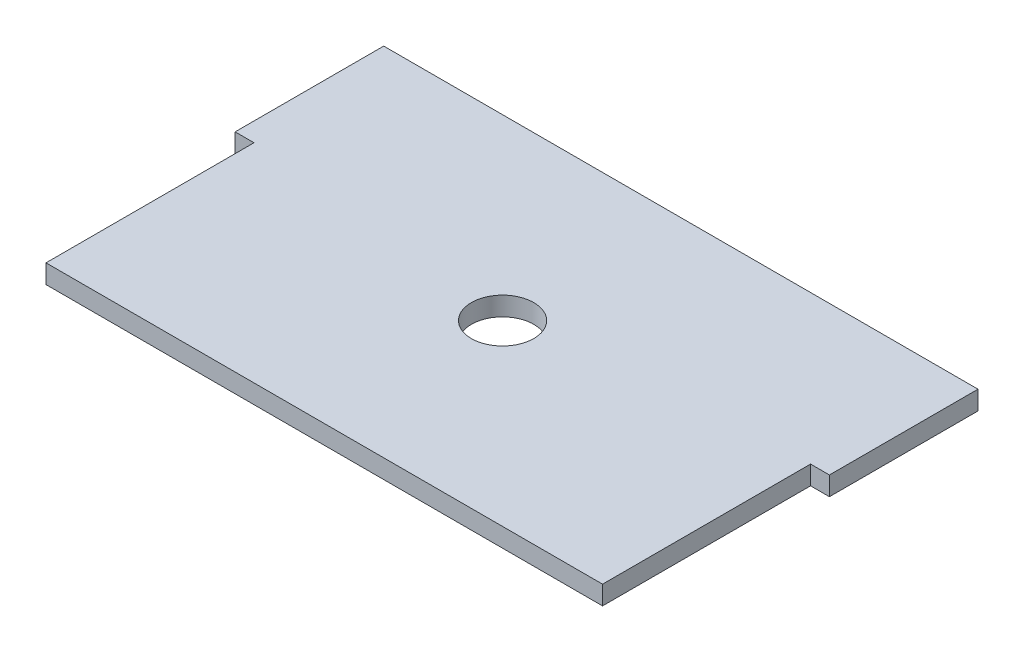
ISO-10303-21;
HEADER;
FILE_DESCRIPTION(('STEP AP214'),'2;1');
FILE_NAME('part.step','',(''),(''),'','','');
FILE_SCHEMA(('AUTOMOTIVE_DESIGN { 1 0 10303 214 1 1 1 1 }'));
ENDSEC;
DATA;
#1=APPLICATION_CONTEXT('core data for automotive mechanical design processes');
#2=APPLICATION_PROTOCOL_DEFINITION('international standard','automotive_design',2000,#1);
#3=PRODUCT_CONTEXT('',#1,'mechanical');
#4=PRODUCT('Part','Part','',(#3));
#5=PRODUCT_RELATED_PRODUCT_CATEGORY('part','',(#4));
#6=PRODUCT_DEFINITION_FORMATION('','',#4);
#7=PRODUCT_DEFINITION_CONTEXT('part definition',#1,'design');
#8=PRODUCT_DEFINITION('design','',#6,#7);
#9=PRODUCT_DEFINITION_SHAPE('','',#8);
#10=(LENGTH_UNIT() NAMED_UNIT(*) SI_UNIT(.MILLI.,.METRE.));
#11=(NAMED_UNIT(*) PLANE_ANGLE_UNIT() SI_UNIT($,.RADIAN.));
#12=(NAMED_UNIT(*) SI_UNIT($,.STERADIAN.) SOLID_ANGLE_UNIT());
#13=UNCERTAINTY_MEASURE_WITH_UNIT(LENGTH_MEASURE(1.E-05),#10,'distance_accuracy_value','');
#14=(GEOMETRIC_REPRESENTATION_CONTEXT(3) GLOBAL_UNCERTAINTY_ASSIGNED_CONTEXT((#13)) GLOBAL_UNIT_ASSIGNED_CONTEXT((#10,
#11,#12)) REPRESENTATION_CONTEXT('',''));
#15=CARTESIAN_POINT('',(0.,0.,0.));
#16=DIRECTION('',(0.,0.,1.));
#17=DIRECTION('',(1.,0.,0.));
#18=AXIS2_PLACEMENT_3D('',#15,#16,#17);
#19=CARTESIAN_POINT('',(0.,3.175,0.));
#20=DIRECTION('',(1.,0.,0.));
#21=DIRECTION('',(0.,0.,-1.));
#22=AXIS2_PLACEMENT_3D('',#19,#20,#21);
#23=PLANE('',#22);
#24=DIRECTION('',(0.,0.,1.));
#25=VECTOR('',#24,1.);
#26=CARTESIAN_POINT('',(0.,0.,0.));
#27=LINE('',#26,#25);
#28=CARTESIAN_POINT('',(0.,0.,0.));
#29=VERTEX_POINT('',#28);
#30=CARTESIAN_POINT('',(0.,0.,25.));
#31=VERTEX_POINT('',#30);
#32=EDGE_CURVE('E126',#29,#31,#27,.T.);
#33=ORIENTED_EDGE('',*,*,#32,.T.);
#34=DIRECTION('',(0.,1.,0.));
#35=VECTOR('',#34,1.);
#36=CARTESIAN_POINT('',(0.,0.,25.));
#37=LINE('',#36,#35);
#38=CARTESIAN_POINT('',(0.,3.175,25.));
#39=VERTEX_POINT('',#38);
#40=EDGE_CURVE('E131',#31,#39,#37,.T.);
#41=ORIENTED_EDGE('',*,*,#40,.T.);
#42=DIRECTION('',(0.,0.,1.));
#43=VECTOR('',#42,1.);
#44=CARTESIAN_POINT('',(0.,3.175,0.));
#45=LINE('',#44,#43);
#46=CARTESIAN_POINT('',(0.,3.175,0.));
#47=VERTEX_POINT('',#46);
#48=EDGE_CURVE('E135',#47,#39,#45,.T.);
#49=ORIENTED_EDGE('',*,*,#48,.F.);
#50=DIRECTION('',(0.,-1.,0.));
#51=VECTOR('',#50,1.);
#52=CARTESIAN_POINT('',(0.,3.175,0.));
#53=LINE('',#52,#51);
#54=EDGE_CURVE('E46',#47,#29,#53,.T.);
#55=ORIENTED_EDGE('',*,*,#54,.T.);
#56=EDGE_LOOP('',(#33,#41,#49,#55));
#57=FACE_BOUND('',#56,.T.);
#58=ADVANCED_FACE('F39',(#57),#23,.F.);
#59=CARTESIAN_POINT('',(0.,3.175,60.));
#60=DIRECTION('',(0.,0.,-1.));
#61=DIRECTION('',(-1.,0.,0.));
#62=AXIS2_PLACEMENT_3D('',#59,#60,#61);
#63=PLANE('',#62);
#64=DIRECTION('',(1.,0.,0.));
#65=VECTOR('',#64,1.);
#66=CARTESIAN_POINT('',(0.,3.175,60.));
#67=LINE('',#66,#65);
#68=CARTESIAN_POINT('',(3.17500000000002,3.175,60.));
#69=VERTEX_POINT('',#68);
#70=CARTESIAN_POINT('',(96.825,3.175,60.));
#71=VERTEX_POINT('',#70);
#72=EDGE_CURVE('E120',#69,#71,#67,.T.);
#73=ORIENTED_EDGE('',*,*,#72,.F.);
#74=DIRECTION('',(0.,1.,0.));
#75=VECTOR('',#74,1.);
#76=CARTESIAN_POINT('',(3.17500000000002,0.,60.));
#77=LINE('',#76,#75);
#78=CARTESIAN_POINT('',(3.17500000000002,0.,60.));
#79=VERTEX_POINT('',#78);
#80=EDGE_CURVE('E107',#79,#69,#77,.T.);
#81=ORIENTED_EDGE('',*,*,#80,.F.);
#82=DIRECTION('',(1.,0.,0.));
#83=VECTOR('',#82,1.);
#84=CARTESIAN_POINT('',(0.,0.,60.));
#85=LINE('',#84,#83);
#86=CARTESIAN_POINT('',(96.825,0.,60.));
#87=VERTEX_POINT('',#86);
#88=EDGE_CURVE('E118',#79,#87,#85,.T.);
#89=ORIENTED_EDGE('',*,*,#88,.T.);
#90=DIRECTION('',(0.,1.,0.));
#91=VECTOR('',#90,1.);
#92=CARTESIAN_POINT('',(96.825,0.,60.));
#93=LINE('',#92,#91);
#94=EDGE_CURVE('E61',#87,#71,#93,.T.);
#95=ORIENTED_EDGE('',*,*,#94,.T.);
#96=EDGE_LOOP('',(#73,#81,#89,#95));
#97=FACE_BOUND('',#96,.T.);
#98=ADVANCED_FACE('F117',(#97),#63,.F.);
#99=CARTESIAN_POINT('',(100.,3.175,0.));
#100=DIRECTION('',(-1.,0.,0.));
#101=DIRECTION('',(0.,0.,1.));
#102=AXIS2_PLACEMENT_3D('',#99,#100,#101);
#103=PLANE('',#102);
#104=DIRECTION('',(0.,0.,-1.));
#105=VECTOR('',#104,1.);
#106=CARTESIAN_POINT('',(100.,3.175,0.));
#107=LINE('',#106,#105);
#108=CARTESIAN_POINT('',(100.,3.175,25.));
#109=VERTEX_POINT('',#108);
#110=CARTESIAN_POINT('',(100.,3.175,0.));
#111=VERTEX_POINT('',#110);
#112=EDGE_CURVE('E142',#109,#111,#107,.T.);
#113=ORIENTED_EDGE('',*,*,#112,.F.);
#114=DIRECTION('',(0.,1.,0.));
#115=VECTOR('',#114,1.);
#116=CARTESIAN_POINT('',(100.,0.,25.));
#117=LINE('',#116,#115);
#118=CARTESIAN_POINT('',(100.,0.,25.));
#119=VERTEX_POINT('',#118);
#120=EDGE_CURVE('E161',#119,#109,#117,.T.);
#121=ORIENTED_EDGE('',*,*,#120,.F.);
#122=DIRECTION('',(0.,0.,-1.));
#123=VECTOR('',#122,1.);
#124=CARTESIAN_POINT('',(100.,0.,0.));
#125=LINE('',#124,#123);
#126=CARTESIAN_POINT('',(100.,0.,0.));
#127=VERTEX_POINT('',#126);
#128=EDGE_CURVE('E125',#119,#127,#125,.T.);
#129=ORIENTED_EDGE('',*,*,#128,.T.);
#130=DIRECTION('',(0.,-1.,0.));
#131=VECTOR('',#130,1.);
#132=CARTESIAN_POINT('',(100.,3.175,0.));
#133=LINE('',#132,#131);
#134=EDGE_CURVE('E11',#111,#127,#133,.T.);
#135=ORIENTED_EDGE('',*,*,#134,.F.);
#136=EDGE_LOOP('',(#113,#121,#129,#135));
#137=FACE_BOUND('',#136,.T.);
#138=ADVANCED_FACE('F191',(#137),#103,.F.);
#139=CARTESIAN_POINT('',(0.,3.175,0.));
#140=DIRECTION('',(0.,0.,1.));
#141=DIRECTION('',(1.,0.,0.));
#142=AXIS2_PLACEMENT_3D('',#139,#140,#141);
#143=PLANE('',#142);
#144=DIRECTION('',(-1.,0.,0.));
#145=VECTOR('',#144,1.);
#146=CARTESIAN_POINT('',(0.,0.,0.));
#147=LINE('',#146,#145);
#148=EDGE_CURVE('E128',#127,#29,#147,.T.);
#149=ORIENTED_EDGE('',*,*,#148,.T.);
#150=ORIENTED_EDGE('',*,*,#54,.F.);
#151=DIRECTION('',(-1.,0.,0.));
#152=VECTOR('',#151,1.);
#153=CARTESIAN_POINT('',(0.,3.175,0.));
#154=LINE('',#153,#152);
#155=EDGE_CURVE('E137',#111,#47,#154,.T.);
#156=ORIENTED_EDGE('',*,*,#155,.F.);
#157=ORIENTED_EDGE('',*,*,#134,.T.);
#158=EDGE_LOOP('',(#149,#150,#156,#157));
#159=FACE_BOUND('',#158,.T.);
#160=ADVANCED_FACE('F181',(#159),#143,.F.);
#161=CARTESIAN_POINT('',(0.,3.175,0.));
#162=DIRECTION('',(0.,1.,0.));
#163=DIRECTION('',(0.,0.,1.));
#164=AXIS2_PLACEMENT_3D('',#161,#162,#163);
#165=PLANE('',#164);
#166=CARTESIAN_POINT('',(50.,3.175,30.));
#167=DIRECTION('',(0.,1.,0.));
#168=DIRECTION('',(0.,0.,1.));
#169=AXIS2_PLACEMENT_3D('',#166,#167,#168);
#170=CIRCLE('',#169,5.25);
#171=CARTESIAN_POINT('',(50.,3.175,35.25));
#172=VERTEX_POINT('',#171);
#173=EDGE_CURVE('E173',#172,#172,#170,.T.);
#174=ORIENTED_EDGE('',*,*,#173,.F.);
#175=EDGE_LOOP('',(#174));
#176=FACE_BOUND('',#175,.T.);
#177=DIRECTION('',(-1.,0.,0.));
#178=VECTOR('',#177,1.);
#179=CARTESIAN_POINT('',(3.17500000000001,3.175,25.));
#180=LINE('',#179,#178);
#181=CARTESIAN_POINT('',(3.17500000000001,3.175,25.));
#182=VERTEX_POINT('',#181);
#183=EDGE_CURVE('E112',#182,#39,#180,.T.);
#184=ORIENTED_EDGE('',*,*,#183,.F.);
#185=DIRECTION('',(0.,0.,-1.));
#186=VECTOR('',#185,1.);
#187=CARTESIAN_POINT('',(3.17500000000001,3.175,25.));
#188=LINE('',#187,#186);
#189=EDGE_CURVE('E156',#69,#182,#188,.T.);
#190=ORIENTED_EDGE('',*,*,#189,.F.);
#191=ORIENTED_EDGE('',*,*,#72,.T.);
#192=DIRECTION('',(0.,0.,1.));
#193=VECTOR('',#192,1.);
#194=CARTESIAN_POINT('',(96.825,3.175,60.));
#195=LINE('',#194,#193);
#196=CARTESIAN_POINT('',(96.825,3.175,25.));
#197=VERTEX_POINT('',#196);
#198=EDGE_CURVE('E154',#197,#71,#195,.T.);
#199=ORIENTED_EDGE('',*,*,#198,.F.);
#200=DIRECTION('',(-1.,0.,0.));
#201=VECTOR('',#200,1.);
#202=CARTESIAN_POINT('',(100.,3.175,25.));
#203=LINE('',#202,#201);
#204=EDGE_CURVE('E151',#109,#197,#203,.T.);
#205=ORIENTED_EDGE('',*,*,#204,.F.);
#206=ORIENTED_EDGE('',*,*,#112,.T.);
#207=ORIENTED_EDGE('',*,*,#155,.T.);
#208=ORIENTED_EDGE('',*,*,#48,.T.);
#209=EDGE_LOOP('',(#184,#190,#191,#199,#205,#206,#207,#208));
#210=FACE_BOUND('',#209,.T.);
#211=ADVANCED_FACE('F179',(#176,#210),#165,.T.);
#212=CARTESIAN_POINT('',(0.,0.,0.));
#213=DIRECTION('',(0.,1.,0.));
#214=DIRECTION('',(0.,0.,1.));
#215=AXIS2_PLACEMENT_3D('',#212,#213,#214);
#216=PLANE('',#215);
#217=CARTESIAN_POINT('',(50.,0.,30.));
#218=DIRECTION('',(0.,1.,0.));
#219=DIRECTION('',(0.,0.,1.));
#220=AXIS2_PLACEMENT_3D('',#217,#218,#219);
#221=CIRCLE('',#220,5.25);
#222=CARTESIAN_POINT('',(50.,0.,35.25));
#223=VERTEX_POINT('',#222);
#224=EDGE_CURVE('E162',#223,#223,#221,.T.);
#225=ORIENTED_EDGE('',*,*,#224,.T.);
#226=EDGE_LOOP('',(#225));
#227=FACE_BOUND('',#226,.T.);
#228=DIRECTION('',(0.,0.,-1.));
#229=VECTOR('',#228,1.);
#230=CARTESIAN_POINT('',(3.17500000000002,0.,60.));
#231=LINE('',#230,#229);
#232=CARTESIAN_POINT('',(3.17500000000001,0.,25.));
#233=VERTEX_POINT('',#232);
#234=EDGE_CURVE('E103',#79,#233,#231,.T.);
#235=ORIENTED_EDGE('',*,*,#234,.T.);
#236=DIRECTION('',(-1.,0.,0.));
#237=VECTOR('',#236,1.);
#238=CARTESIAN_POINT('',(3.17500000000001,0.,25.));
#239=LINE('',#238,#237);
#240=EDGE_CURVE('E53',#233,#31,#239,.T.);
#241=ORIENTED_EDGE('',*,*,#240,.T.);
#242=ORIENTED_EDGE('',*,*,#32,.F.);
#243=ORIENTED_EDGE('',*,*,#148,.F.);
#244=ORIENTED_EDGE('',*,*,#128,.F.);
#245=DIRECTION('',(-1.,0.,0.));
#246=VECTOR('',#245,1.);
#247=CARTESIAN_POINT('',(100.,0.,25.));
#248=LINE('',#247,#246);
#249=CARTESIAN_POINT('',(96.825,0.,25.));
#250=VERTEX_POINT('',#249);
#251=EDGE_CURVE('E152',#119,#250,#248,.T.);
#252=ORIENTED_EDGE('',*,*,#251,.T.);
#253=DIRECTION('',(0.,0.,1.));
#254=VECTOR('',#253,1.);
#255=CARTESIAN_POINT('',(96.825,0.,25.));
#256=LINE('',#255,#254);
#257=EDGE_CURVE('E124',#250,#87,#256,.T.);
#258=ORIENTED_EDGE('',*,*,#257,.T.);
#259=ORIENTED_EDGE('',*,*,#88,.F.);
#260=EDGE_LOOP('',(#235,#241,#242,#243,#244,#252,#258,#259));
#261=FACE_BOUND('',#260,.T.);
#262=ADVANCED_FACE('F122',(#227,#261),#216,.F.);
#263=CARTESIAN_POINT('',(100.,0.,25.));
#264=DIRECTION('',(0.,0.,-1.));
#265=DIRECTION('',(-1.,0.,0.));
#266=AXIS2_PLACEMENT_3D('',#263,#264,#265);
#267=PLANE('',#266);
#268=ORIENTED_EDGE('',*,*,#204,.T.);
#269=DIRECTION('',(0.,1.,0.));
#270=VECTOR('',#269,1.);
#271=CARTESIAN_POINT('',(96.825,0.,25.));
#272=LINE('',#271,#270);
#273=EDGE_CURVE('E159',#250,#197,#272,.T.);
#274=ORIENTED_EDGE('',*,*,#273,.F.);
#275=ORIENTED_EDGE('',*,*,#251,.F.);
#276=ORIENTED_EDGE('',*,*,#120,.T.);
#277=EDGE_LOOP('',(#268,#274,#275,#276));
#278=FACE_BOUND('',#277,.T.);
#279=ADVANCED_FACE('F195',(#278),#267,.F.);
#280=CARTESIAN_POINT('',(96.825,0.,60.));
#281=DIRECTION('',(-1.,0.,0.));
#282=DIRECTION('',(0.,0.,1.));
#283=AXIS2_PLACEMENT_3D('',#280,#281,#282);
#284=PLANE('',#283);
#285=ORIENTED_EDGE('',*,*,#198,.T.);
#286=ORIENTED_EDGE('',*,*,#94,.F.);
#287=ORIENTED_EDGE('',*,*,#257,.F.);
#288=ORIENTED_EDGE('',*,*,#273,.T.);
#289=EDGE_LOOP('',(#285,#286,#287,#288));
#290=FACE_BOUND('',#289,.T.);
#291=ADVANCED_FACE('F197',(#290),#284,.F.);
#292=CARTESIAN_POINT('',(3.17500000000001,0.,25.));
#293=DIRECTION('',(0.,0.,-1.));
#294=DIRECTION('',(-1.,0.,0.));
#295=AXIS2_PLACEMENT_3D('',#292,#293,#294);
#296=PLANE('',#295);
#297=ORIENTED_EDGE('',*,*,#183,.T.);
#298=ORIENTED_EDGE('',*,*,#40,.F.);
#299=ORIENTED_EDGE('',*,*,#240,.F.);
#300=DIRECTION('',(0.,1.,0.));
#301=VECTOR('',#300,1.);
#302=CARTESIAN_POINT('',(3.17500000000001,0.,25.));
#303=LINE('',#302,#301);
#304=EDGE_CURVE('E109',#233,#182,#303,.T.);
#305=ORIENTED_EDGE('',*,*,#304,.T.);
#306=EDGE_LOOP('',(#297,#298,#299,#305));
#307=FACE_BOUND('',#306,.T.);
#308=ADVANCED_FACE('F184',(#307),#296,.F.);
#309=CARTESIAN_POINT('',(3.17500000000001,0.,25.));
#310=DIRECTION('',(1.,0.,0.));
#311=DIRECTION('',(0.,0.,-1.));
#312=AXIS2_PLACEMENT_3D('',#309,#310,#311);
#313=PLANE('',#312);
#314=ORIENTED_EDGE('',*,*,#189,.T.);
#315=ORIENTED_EDGE('',*,*,#304,.F.);
#316=ORIENTED_EDGE('',*,*,#234,.F.);
#317=ORIENTED_EDGE('',*,*,#80,.T.);
#318=EDGE_LOOP('',(#314,#315,#316,#317));
#319=FACE_BOUND('',#318,.T.);
#320=ADVANCED_FACE('F106',(#319),#313,.F.);
#321=CARTESIAN_POINT('',(50.,3.175,30.));
#322=DIRECTION('',(0.,1.,0.));
#323=DIRECTION('',(0.,0.,1.));
#324=AXIS2_PLACEMENT_3D('',#321,#322,#323);
#325=CYLINDRICAL_SURFACE('',#324,5.25);
#326=ORIENTED_EDGE('',*,*,#224,.F.);
#327=EDGE_LOOP('',(#326));
#328=FACE_BOUND('',#327,.T.);
#329=ORIENTED_EDGE('',*,*,#173,.T.);
#330=EDGE_LOOP('',(#329));
#331=FACE_BOUND('',#330,.T.);
#332=ADVANCED_FACE('F177',(#328,#331),#325,.F.);
#333=CLOSED_SHELL('',(#58,#98,#138,#160,#211,#262,#279,#291,#308,#320,#332));
#334=MANIFOLD_SOLID_BREP('B2',#333);
#335=ADVANCED_BREP_SHAPE_REPRESENTATION('',(#18,#334),#14);
#336=SHAPE_DEFINITION_REPRESENTATION(#9,#335);
ENDSEC;
END-ISO-10303-21;
